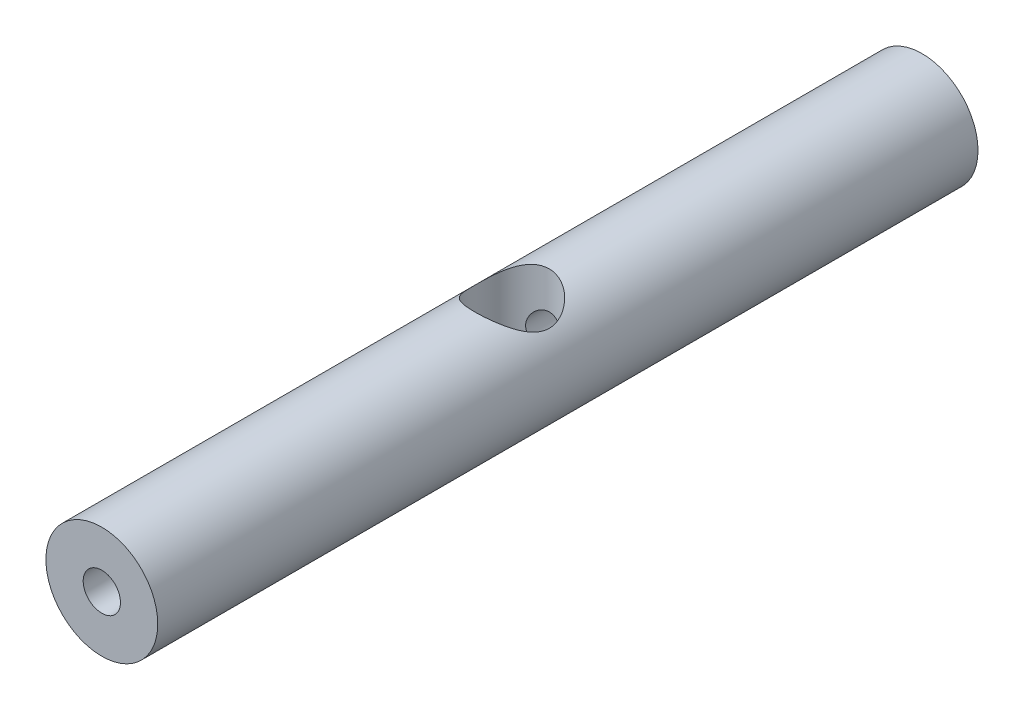
ISO-10303-21;
HEADER;
FILE_DESCRIPTION(('STEP AP214'),'2;1');
FILE_NAME('part.step','',(''),(''),'','','');
FILE_SCHEMA(('AUTOMOTIVE_DESIGN { 1 0 10303 214 1 1 1 1 }'));
ENDSEC;
DATA;
#1=APPLICATION_CONTEXT('core data for automotive mechanical design processes');
#2=APPLICATION_PROTOCOL_DEFINITION('international standard','automotive_design',2000,#1);
#3=PRODUCT_CONTEXT('',#1,'mechanical');
#4=PRODUCT('Part','Part','',(#3));
#5=PRODUCT_RELATED_PRODUCT_CATEGORY('part','',(#4));
#6=PRODUCT_DEFINITION_FORMATION('','',#4);
#7=PRODUCT_DEFINITION_CONTEXT('part definition',#1,'design');
#8=PRODUCT_DEFINITION('design','',#6,#7);
#9=PRODUCT_DEFINITION_SHAPE('','',#8);
#10=(LENGTH_UNIT() NAMED_UNIT(*) SI_UNIT(.MILLI.,.METRE.));
#11=(NAMED_UNIT(*) PLANE_ANGLE_UNIT() SI_UNIT($,.RADIAN.));
#12=(NAMED_UNIT(*) SI_UNIT($,.STERADIAN.) SOLID_ANGLE_UNIT());
#13=UNCERTAINTY_MEASURE_WITH_UNIT(LENGTH_MEASURE(1.E-05),#10,'distance_accuracy_value','');
#14=(GEOMETRIC_REPRESENTATION_CONTEXT(3) GLOBAL_UNCERTAINTY_ASSIGNED_CONTEXT((#13)) GLOBAL_UNIT_ASSIGNED_CONTEXT((#10,
#11,#12)) REPRESENTATION_CONTEXT('',''));
#15=CARTESIAN_POINT('',(0.,0.,0.));
#16=DIRECTION('',(0.,0.,1.));
#17=DIRECTION('',(1.,0.,0.));
#18=AXIS2_PLACEMENT_3D('',#15,#16,#17);
#19=CARTESIAN_POINT('',(0.,0.,132.));
#20=DIRECTION('',(0.,0.,-1.));
#21=DIRECTION('',(-1.,0.,0.));
#22=AXIS2_PLACEMENT_3D('',#19,#20,#21);
#23=CYLINDRICAL_SURFACE('',#22,3.);
#24=CARTESIAN_POINT('',(-3.,0.,71.1961524227066));
#25=CARTESIAN_POINT('',(-2.99999910875738,-0.0782002332591001,71.1961533815141));
#26=CARTESIAN_POINT('',(-2.99693611207795,-0.156409998464572,71.1979258119113));
#27=CARTESIAN_POINT('',(-2.98473565374509,-0.312208075142055,71.2049393165712));
#28=CARTESIAN_POINT('',(-2.97559536411629,-0.389796080268496,71.2101820056608));
#29=CARTESIAN_POINT('',(-2.9391691225804,-0.620944014246429,71.2308820055821));
#30=CARTESIAN_POINT('',(-2.902878058149,-0.772750910533257,71.2513107660722));
#31=CARTESIAN_POINT('',(-2.80829998089522,-1.06639163352355,71.3024774692754));
#32=CARTESIAN_POINT('',(-2.75012989346617,-1.2082738017509,71.3331605157792));
#33=CARTESIAN_POINT('',(-2.61380253964662,-1.48026276170082,71.4012807296697));
#34=CARTESIAN_POINT('',(-2.53564419197538,-1.61036891587492,71.4387182624135));
#35=CARTESIAN_POINT('',(-2.35399963256537,-1.86692014614772,71.5199058355984));
#36=CARTESIAN_POINT('',(-2.24895611137364,-1.99217820215593,71.5639218457163));
#37=CARTESIAN_POINT('',(-2.01976141989962,-2.22422436968954,71.651159547025));
#38=CARTESIAN_POINT('',(-1.89560077655245,-2.33100326825669,71.6943808324562));
#39=CARTESIAN_POINT('',(-1.62146869109162,-2.53010168773233,71.7786442898889));
#40=CARTESIAN_POINT('',(-1.47032156718995,-2.62096136592723,71.8193431875224));
#41=CARTESIAN_POINT('',(-1.1524710796464,-2.77542249742807,71.8905226880054));
#42=CARTESIAN_POINT('',(-0.985777614653097,-2.83904115324657,71.9210097369081));
#43=CARTESIAN_POINT('',(-0.65413483155629,-2.93251399798917,71.9664138360306));
#44=CARTESIAN_POINT('',(-0.489905370480172,-2.96444857964805,71.9822844059558));
#45=CARTESIAN_POINT('',(-0.157711887079236,-3.00049835544401,72.0002275160526));
#46=CARTESIAN_POINT('',(0.0102498138110328,-3.00463038213226,72.0023084049244));
#47=CARTESIAN_POINT('',(0.329497576667916,-2.98575996736519,71.9928894562274));
#48=CARTESIAN_POINT('',(0.480963609704586,-2.96508591192196,71.9825548724797));
#49=CARTESIAN_POINT('',(0.777941303579838,-2.90135750980351,71.9512273620779));
#50=CARTESIAN_POINT('',(0.923452517976627,-2.85830148842212,71.9302336378681));
#51=CARTESIAN_POINT('',(1.20692822064062,-2.75075214423043,71.8791474825337));
#52=CARTESIAN_POINT('',(1.34476044303001,-2.68597046879936,71.8489331854518));
#53=CARTESIAN_POINT('',(1.60793023199368,-2.53721034329205,71.7821294400464));
#54=CARTESIAN_POINT('',(1.73326330217191,-2.45322502049034,71.7455377104437));
#55=CARTESIAN_POINT('',(1.98052168794677,-2.25931152606046,71.665331584921));
#56=CARTESIAN_POINT('',(2.10100497271934,-2.14768148935835,71.6213803174283));
#57=CARTESIAN_POINT('',(2.32231036115798,-1.90624025809114,71.5336311808584));
#58=CARTESIAN_POINT('',(2.42311733790258,-1.77641520610432,71.4898334550261));
#59=CARTESIAN_POINT('',(2.6085269546345,-1.49201785665928,71.4043208466553));
#60=CARTESIAN_POINT('',(2.691694028528,-1.33639756435402,71.3629148575067));
#61=CARTESIAN_POINT('',(2.79542837524198,-1.09243694538825,71.3091519440867));
#62=CARTESIAN_POINT('',(2.82650797342001,-1.00934368959524,71.2926194649543));
#63=CARTESIAN_POINT('',(2.88131297532033,-0.840191396965576,71.2629847346327));
#64=CARTESIAN_POINT('',(2.90504291399185,-0.754134225525218,71.2498803689785));
#65=CARTESIAN_POINT('',(2.94323927983804,-0.586628379775977,71.2285545598839));
#66=CARTESIAN_POINT('',(2.95828810706486,-0.50535057436216,71.2200298226321));
#67=CARTESIAN_POINT('',(2.98163903200842,-0.341564761334108,71.2067273715729));
#68=CARTESIAN_POINT('',(2.98994463830255,-0.259057416251687,71.2019477092041));
#69=CARTESIAN_POINT('',(2.99968663811345,-0.0935289931972984,71.1963366286361));
#70=CARTESIAN_POINT('',(3.00112558946313,-0.0105081180563068,71.1955037402621));
#71=CARTESIAN_POINT('',(2.99712742537403,0.15528646076465,71.1978095319997));
#72=CARTESIAN_POINT('',(2.99169077406597,0.23806018075052,71.2009479440325));
#73=CARTESIAN_POINT('',(2.96710135231213,0.466859136042691,71.2150449301025));
#74=CARTESIAN_POINT('',(2.9405616310018,0.611910810263269,71.230191606605));
#75=CARTESIAN_POINT('',(2.8670906736223,0.895130910796864,71.270816663845));
#76=CARTESIAN_POINT('',(2.82015283383764,1.03329709183022,71.2962983902877));
#77=CARTESIAN_POINT('',(2.70494224478443,1.30622610391992,71.3560878027303));
#78=CARTESIAN_POINT('',(2.63578205088436,1.4405349279041,71.3907496041273));
#79=CARTESIAN_POINT('',(2.47886133231338,1.69640993836604,71.4646832779242));
#80=CARTESIAN_POINT('',(2.39109125263821,1.81796953081147,71.5039575138799));
#81=CARTESIAN_POINT('',(2.18651145695799,2.06093562663186,71.588640051403));
#82=CARTESIAN_POINT('',(2.067435804994,2.18039127090002,71.6341975208474));
#83=CARTESIAN_POINT('',(1.81021349814979,2.39823689529484,71.7220270231092));
#84=CARTESIAN_POINT('',(1.67206042712514,2.4966197596755,71.7642979430823));
#85=CARTESIAN_POINT('',(1.37560608443379,2.67172112757365,71.8422408580664));
#86=CARTESIAN_POINT('',(1.21686929217555,2.74779934188309,71.8777092522688));
#87=CARTESIAN_POINT('',(0.886567094469553,2.87141372431059,71.9365006466729));
#88=CARTESIAN_POINT('',(0.715013103124012,2.91897495484196,71.9598343091953));
#89=CARTESIAN_POINT('',(0.380939047947203,2.98010569184912,71.9900252464518));
#90=CARTESIAN_POINT('',(0.219034335650397,2.99639363556079,71.998197839307));
#91=CARTESIAN_POINT('',(-0.105377961951193,3.00252978843353,72.0012639091934));
#92=CARTESIAN_POINT('',(-0.267885316317455,2.99238725318317,71.9961620347605));
#93=CARTESIAN_POINT('',(-0.577613962536137,2.9477508098665,71.9740190719064));
#94=CARTESIAN_POINT('',(-0.725136901247721,2.91490556233434,71.9577868644244));
#95=CARTESIAN_POINT('',(-1.01233790874441,2.82801889196794,71.9157627855145));
#96=CARTESIAN_POINT('',(-1.15201484923628,2.77397442945753,71.8899695431946));
#97=CARTESIAN_POINT('',(-1.42627001605163,2.64381927131126,71.829778017116));
#98=CARTESIAN_POINT('',(-1.56037465678411,2.56686365846372,71.7950588762329));
#99=CARTESIAN_POINT('',(-1.81432469711303,2.39412457858644,71.7206436338201));
#100=CARTESIAN_POINT('',(-1.93416350676913,2.29833246401127,71.6809452494399));
#101=CARTESIAN_POINT('',(-2.16873884087782,2.07961527751646,71.5958597881944));
#102=CARTESIAN_POINT('',(-2.28178066887875,1.9549386792264,71.5502997550452));
#103=CARTESIAN_POINT('',(-2.48600225783028,1.68762167192986,71.4618864950968));
#104=CARTESIAN_POINT('',(-2.57716267726705,1.54496553896892,71.4190356875087));
#105=CARTESIAN_POINT('',(-2.69665559342489,1.31746820669823,71.3600477490699));
#106=CARTESIAN_POINT('',(-2.73405408762355,1.23802419901759,71.3410121914846));
#107=CARTESIAN_POINT('',(-2.80191257626505,1.07564671699129,71.3057278306372));
#108=CARTESIAN_POINT('',(-2.83237614466584,0.992715066252001,71.2894775930144));
#109=CARTESIAN_POINT('',(-2.88592624586958,0.824155267630252,71.2604521586818));
#110=CARTESIAN_POINT('',(-2.90903175649394,0.73853469275864,71.2476680350909));
#111=CARTESIAN_POINT('',(-2.9476242805163,0.565144744685739,71.2260886962511));
#112=CARTESIAN_POINT('',(-2.96311662049621,0.477376919079381,71.2172906924366));
#113=CARTESIAN_POINT('',(-2.9830938122572,0.324601182240059,71.2058852801613));
#114=CARTESIAN_POINT('',(-2.9894274622838,0.259905191093013,71.2022444258814));
#115=CARTESIAN_POINT('',(-2.99788106792142,0.130141683200318,71.1973775174469));
#116=CARTESIAN_POINT('',(-3.00000074164547,0.0650741418923936,71.1961516248372));
#117=CARTESIAN_POINT('',(-3.,0.,71.1961524227066));
#118=B_SPLINE_CURVE_WITH_KNOTS('',3,(#24,#25,#26,#27,#28,#29,#30,#31,#32,#33,#34,#35,#36,#37,
#38,#39,#40,#41,#42,#43,#44,#45,#46,#47,#48,#49,#50,#51,#52,#53,#54,#55,#56,#57,#58,#59,#60,#61,
#62,#63,#64,#65,#66,#67,#68,#69,#70,#71,#72,#73,#74,#75,#76,#77,#78,#79,#80,#81,#82,#83,#84,#85,
#86,#87,#88,#89,#90,#91,#92,#93,#94,#95,#96,#97,#98,#99,#100,#101,#102,#103,#104,#105,#106,#107,
#108,#109,#110,#111,#112,#113,#114,#115,#116,#117),.UNSPECIFIED.,.T.,.F.,(4,2,2,2,2,2,2,2,2,2,2,
2,2,2,2,2,2,2,2,2,2,2,2,2,2,2,2,2,2,2,2,2,2,2,2,2,2,2,2,2,2,2,2,2,2,2,4),(0.,0.234529430733891,
0.469168072604263,0.93885038329453,1.40605749261242,1.87328988121656,2.37905864237582,
2.88507883741224,3.42520847204401,3.96499651379785,4.46637625391917,4.96745241546231,
5.42495462941727,5.88249108040477,6.34635774681552,6.81039068538928,7.31828744858783,
7.82657315225867,8.36713695676456,8.63752916119813,8.90775419202327,9.15669600787593,
9.40550821320573,9.65422772860786,9.90293045534219,10.3454331624118,10.7880792327729,
11.2512265518736,11.7146122462924,12.2364099671094,12.7583836090371,13.29413310208,
13.8294110539541,14.3155757713756,14.8015702635101,15.2555404058358,15.7095756650514,
16.1830301812752,16.6567025627126,17.177514915193,17.6987859450456,17.9680115893229,
18.2370981707631,18.5054849980179,18.7736837791728,18.9688338446807,19.1639969639894),.UNSPECIFIED.);
#119=CARTESIAN_POINT('',(-3.,0.,71.1961524227066));
#120=VERTEX_POINT('',#119);
#121=EDGE_CURVE('E41',#120,#120,#118,.T.);
#122=ORIENTED_EDGE('',*,*,#121,.F.);
#123=EDGE_LOOP('',(#122));
#124=FACE_BOUND('',#123,.T.);
#125=CARTESIAN_POINT('',(0.,0.,132.));
#126=DIRECTION('',(0.,0.,1.));
#127=DIRECTION('',(1.,0.,0.));
#128=AXIS2_PLACEMENT_3D('',#125,#126,#127);
#129=CIRCLE('',#128,3.);
#130=CARTESIAN_POINT('',(3.,0.,132.));
#131=VERTEX_POINT('',#130);
#132=EDGE_CURVE('E55',#131,#131,#129,.T.);
#133=ORIENTED_EDGE('',*,*,#132,.T.);
#134=EDGE_LOOP('',(#133));
#135=FACE_BOUND('',#134,.T.);
#136=ADVANCED_FACE('F36',(#124,#135),#23,.F.);
#137=CARTESIAN_POINT('',(0.,0.,132.));
#138=DIRECTION('',(0.,0.,1.));
#139=DIRECTION('',(1.,0.,0.));
#140=AXIS2_PLACEMENT_3D('',#137,#138,#139);
#141=PLANE('',#140);
#142=CARTESIAN_POINT('',(0.,0.,132.));
#143=DIRECTION('',(0.,0.,1.));
#144=DIRECTION('',(1.,0.,0.));
#145=AXIS2_PLACEMENT_3D('',#142,#143,#144);
#146=CIRCLE('',#145,9.);
#147=CARTESIAN_POINT('',(9.,0.,132.));
#148=VERTEX_POINT('',#147);
#149=EDGE_CURVE('E10',#148,#148,#146,.T.);
#150=ORIENTED_EDGE('',*,*,#149,.T.);
#151=EDGE_LOOP('',(#150));
#152=FACE_BOUND('',#151,.T.);
#153=ORIENTED_EDGE('',*,*,#132,.F.);
#154=EDGE_LOOP('',(#153));
#155=FACE_BOUND('',#154,.T.);
#156=ADVANCED_FACE('F103',(#152,#155),#141,.T.);
#157=CARTESIAN_POINT('',(0.,0.,0.));
#158=DIRECTION('',(0.,0.,1.));
#159=DIRECTION('',(1.,0.,0.));
#160=AXIS2_PLACEMENT_3D('',#157,#158,#159);
#161=PLANE('',#160);
#162=CARTESIAN_POINT('',(0.,0.,0.));
#163=DIRECTION('',(0.,0.,1.));
#164=DIRECTION('',(1.,0.,0.));
#165=AXIS2_PLACEMENT_3D('',#162,#163,#164);
#166=CIRCLE('',#165,9.);
#167=CARTESIAN_POINT('',(9.,0.,0.));
#168=VERTEX_POINT('',#167);
#169=EDGE_CURVE('E50',#168,#168,#166,.T.);
#170=ORIENTED_EDGE('',*,*,#169,.F.);
#171=EDGE_LOOP('',(#170));
#172=FACE_BOUND('',#171,.T.);
#173=CARTESIAN_POINT('',(0.,0.,0.));
#174=DIRECTION('',(0.,0.,1.));
#175=DIRECTION('',(1.,0.,0.));
#176=AXIS2_PLACEMENT_3D('',#173,#174,#175);
#177=CIRCLE('',#176,3.);
#178=CARTESIAN_POINT('',(3.,0.,0.));
#179=VERTEX_POINT('',#178);
#180=EDGE_CURVE('E58',#179,#179,#177,.T.);
#181=ORIENTED_EDGE('',*,*,#180,.T.);
#182=EDGE_LOOP('',(#181));
#183=FACE_BOUND('',#182,.T.);
#184=ADVANCED_FACE('F93',(#172,#183),#161,.F.);
#185=CARTESIAN_POINT('',(0.,0.,132.));
#186=DIRECTION('',(0.,0.,-1.));
#187=DIRECTION('',(-1.,0.,0.));
#188=AXIS2_PLACEMENT_3D('',#185,#186,#187);
#189=CYLINDRICAL_SURFACE('',#188,9.);
#190=CARTESIAN_POINT('',(0.,-9.,72.));
#191=CARTESIAN_POINT('',(0.150729622305847,-8.99999995585147,71.9999999559956));
#192=CARTESIAN_POINT('',(0.30146000506175,-8.9962053679738,71.9943125473159));
#193=CARTESIAN_POINT('',(0.601688556515674,-8.98112265027612,71.9716526321313));
#194=CARTESIAN_POINT('',(0.751186718723976,-8.96983448101525,71.9546800662295));
#195=CARTESIAN_POINT('',(1.04780606417449,-8.94004058807467,71.9097046619316));
#196=CARTESIAN_POINT('',(1.19492680669762,-8.92153354180874,71.8816998022755));
#197=CARTESIAN_POINT('',(1.48576112693977,-8.87773364005912,71.8150481308273));
#198=CARTESIAN_POINT('',(1.62947322817571,-8.85243790037608,71.7763967956597));
#199=CARTESIAN_POINT('',(1.91177872558019,-8.79577830450418,71.6891836618752));
#200=CARTESIAN_POINT('',(2.05039477937361,-8.76444655793924,71.6406742333665));
#201=CARTESIAN_POINT('',(2.32256233058594,-8.69628785219886,71.5341745859493));
#202=CARTESIAN_POINT('',(2.45611182989863,-8.659458752704,71.4761806735416));
#203=CARTESIAN_POINT('',(2.84809658114958,-8.5418139271305,71.2888649014295));
#204=CARTESIAN_POINT('',(3.09811195500101,-8.4537898193218,71.1461324710248));
#205=CARTESIAN_POINT('',(3.59189330885236,-8.25681534514022,70.8160181983792));
#206=CARTESIAN_POINT('',(3.83332869268148,-8.1467230749831,70.6258753146249));
#207=CARTESIAN_POINT('',(4.28319637469339,-7.91945321886923,70.2127909305365));
#208=CARTESIAN_POINT('',(4.49158048555778,-7.80226562576429,69.9898024392184));
#209=CARTESIAN_POINT('',(4.79239457135195,-7.61903553612194,69.6144242929305));
#210=CARTESIAN_POINT('',(4.89672662856445,-7.55221574084949,69.4717966225412));
#211=CARTESIAN_POINT('',(5.09292728943465,-7.42132140336271,69.1770239207678));
#212=CARTESIAN_POINT('',(5.18479306305095,-7.35724748675706,69.0248767397213));
#213=CARTESIAN_POINT('',(5.44039994615966,-7.17258665154311,68.5551487541104));
#214=CARTESIAN_POINT('',(5.58476240011457,-7.05916900886956,68.2235231774815));
#215=CARTESIAN_POINT('',(5.78024082559468,-6.89928079390124,67.6297790727978));
#216=CARTESIAN_POINT('',(5.84624506230704,-6.84293565925667,67.3752375741416));
#217=CARTESIAN_POINT('',(5.91998570312694,-6.77899474935292,66.9855329434063));
#218=CARTESIAN_POINT('',(5.94035188146208,-6.76111360358516,66.8543697224215));
#219=CARTESIAN_POINT('',(5.97238672990614,-6.7328353656429,66.5901574587245));
#220=CARTESIAN_POINT('',(5.9840553523498,-6.72243831448352,66.4571084056815));
#221=CARTESIAN_POINT('',(5.99850615759971,-6.70954663359649,66.1895908995565));
#222=CARTESIAN_POINT('',(6.00125134141578,-6.70708490621809,66.055118850243));
#223=CARTESIAN_POINT('',(5.99770198955946,-6.71025905496977,65.7863915252174));
#224=CARTESIAN_POINT('',(5.9914074231807,-6.71589495860601,65.6521362502431));
#225=CARTESIAN_POINT('',(5.96988769246359,-6.73503137215892,65.3848377078067));
#226=CARTESIAN_POINT('',(5.95465768785754,-6.74853614456245,65.2517951369556));
#227=CARTESIAN_POINT('',(5.91553265422361,-6.78285629118457,64.9879261164484));
#228=CARTESIAN_POINT('',(5.89163397696999,-6.80367474326148,64.8571006241537));
#229=CARTESIAN_POINT('',(5.80996444024943,-6.87381692297076,64.4807585202742));
#230=CARTESIAN_POINT('',(5.74115656052931,-6.93184442552376,64.2391604481481));
#231=CARTESIAN_POINT('',(5.57609833845702,-7.06528890582514,63.7708844550503));
#232=CARTESIAN_POINT('',(5.47983896595981,-7.14071160414417,63.5442114739251));
#233=CARTESIAN_POINT('',(5.24022208796984,-7.31892320954063,63.0629456381566));
#234=CARTESIAN_POINT('',(5.09126717645734,-7.42415802950434,62.8120520699891));
#235=CARTESIAN_POINT('',(4.76004317394312,-7.64075764898376,62.3358180033));
#236=CARTESIAN_POINT('',(4.57773299424654,-7.75212988931612,62.1105095828303));
#237=CARTESIAN_POINT('',(4.25962918712963,-7.92935002667425,61.7707528113235));
#238=CARTESIAN_POINT('',(4.13357696363757,-7.99594629678862,61.6474427734314));
#239=CARTESIAN_POINT('',(3.87038124621715,-8.12660477277739,61.411827223816));
#240=CARTESIAN_POINT('',(3.73324106763131,-8.19066772765438,61.2995184447223));
#241=CARTESIAN_POINT('',(3.44840396167416,-8.31460339064872,61.0867427032238));
#242=CARTESIAN_POINT('',(3.30071231639902,-8.37447816608008,60.9862698815132));
#243=CARTESIAN_POINT('',(2.99534256192436,-8.48848992914057,60.7980709141005));
#244=CARTESIAN_POINT('',(2.83766721772882,-8.54262849441553,60.7103412611342));
#245=CARTESIAN_POINT('',(2.54499814107467,-8.63375113458628,60.5645399537867));
#246=CARTESIAN_POINT('',(2.41161567122494,-8.67201774379611,60.504025505963));
#247=CARTESIAN_POINT('',(2.1395432193142,-8.74311799376198,60.3925086947129));
#248=CARTESIAN_POINT('',(2.00085431903208,-8.77595273467916,60.3415044048491));
#249=CARTESIAN_POINT('',(1.71897681367333,-8.83548832961116,60.2496018557594));
#250=CARTESIAN_POINT('',(1.57579110331518,-8.86219304127522,60.2086972395404));
#251=CARTESIAN_POINT('',(1.28572629859266,-8.9088991637229,60.1374742840091));
#252=CARTESIAN_POINT('',(1.13884714744994,-8.92890047138895,60.1071561075462));
#253=CARTESIAN_POINT('',(0.841791942137075,-8.96179736848291,60.0574280058098));
#254=CARTESIAN_POINT('',(0.691604277461544,-8.97466149510723,60.0380663728554));
#255=CARTESIAN_POINT('',(0.389735976642209,-8.99282868173345,60.0107536328989));
#256=CARTESIAN_POINT('',(0.238055338547848,-8.99813173185554,60.0028025408066));
#257=CARTESIAN_POINT('',(-0.0655394290023317,-9.00104153419543,59.9984375957279));
#258=CARTESIAN_POINT('',(-0.21745354857653,-8.9986486036265,60.0020232672186));
#259=CARTESIAN_POINT('',(-0.520254440302942,-8.98622801322276,60.0206737424055));
#260=CARTESIAN_POINT('',(-0.671141256025337,-8.97620067924044,60.035738056169));
#261=CARTESIAN_POINT('',(-0.960099063451837,-8.94973490388407,60.0756468841774));
#262=CARTESIAN_POINT('',(-1.09832305580763,-8.93379881037894,60.0997262199985));
#263=CARTESIAN_POINT('',(-1.37199636544237,-8.89588211668836,60.1572962205978));
#264=CARTESIAN_POINT('',(-1.50744472377706,-8.87389946410455,60.1907900810558));
#265=CARTESIAN_POINT('',(-1.77469424179228,-8.82433671407074,60.2667853981939));
#266=CARTESIAN_POINT('',(-1.90649647878767,-8.79675829050981,60.3092841613634));
#267=CARTESIAN_POINT('',(-2.1658509536026,-8.7365239583071,60.402846845352));
#268=CARTESIAN_POINT('',(-2.29340153573778,-8.70386609903955,60.453914057258));
#269=CARTESIAN_POINT('',(-2.6838456858226,-8.5949191182637,60.6259059367114));
#270=CARTESIAN_POINT('',(-2.93844728759671,-8.51070479139786,60.7610487628929));
#271=CARTESIAN_POINT('',(-3.42209036372161,-8.32804697564181,61.0633155789126));
#272=CARTESIAN_POINT('',(-3.65111591352081,-8.22959470828607,61.2304593198005));
#273=CARTESIAN_POINT('',(-4.11554429130496,-8.0086435844533,61.6218098942814));
#274=CARTESIAN_POINT('',(-4.34622868572373,-7.88480405646166,61.8508606735172));
#275=CARTESIAN_POINT('',(-4.76804600199323,-7.63711582679969,62.3433724228123));
#276=CARTESIAN_POINT('',(-4.95915158704086,-7.51326717750209,62.6068569725143));
#277=CARTESIAN_POINT('',(-5.20616918569022,-7.34198751964741,63.013675515455));
#278=CARTESIAN_POINT('',(-5.27921697702153,-7.28951977901592,63.144730681585));
#279=CARTESIAN_POINT('',(-5.41584589984555,-7.18858887021074,63.4132448734983));
#280=CARTESIAN_POINT('',(-5.47942590699138,-7.14012617796028,63.5507046573213));
#281=CARTESIAN_POINT('',(-5.59646403292409,-7.04876602779049,63.8314319756609));
#282=CARTESIAN_POINT('',(-5.64993546336318,-7.00586127458741,63.9746915662796));
#283=CARTESIAN_POINT('',(-5.74620164834171,-6.92712329196491,64.2665774033504));
#284=CARTESIAN_POINT('',(-5.78900316794111,-6.89128558484322,64.4152001805847));
#285=CARTESIAN_POINT('',(-5.85661826485718,-6.83385842215743,64.6899288398305));
#286=CARTESIAN_POINT('',(-5.88328161294608,-6.81086609963069,64.8152877145369));
#287=CARTESIAN_POINT('',(-5.92862999751556,-6.77142914495135,65.0684079319194));
#288=CARTESIAN_POINT('',(-5.94731901928204,-6.75498124240745,65.1961680411329));
#289=CARTESIAN_POINT('',(-5.97643608474823,-6.72923413020984,65.4532527383072));
#290=CARTESIAN_POINT('',(-5.98687017789309,-6.7199296857762,65.5825761099697));
#291=CARTESIAN_POINT('',(-5.99932331015652,-6.70881432384085,65.841953936801));
#292=CARTESIAN_POINT('',(-6.0013422264647,-6.70700351570064,65.9720084026117));
#293=CARTESIAN_POINT('',(-5.99692459405667,-6.71095435083986,66.2319359573732));
#294=CARTESIAN_POINT('',(-5.99048321844488,-6.71672031693769,66.3618089004262));
#295=CARTESIAN_POINT('',(-5.96925971270465,-6.73558614063362,66.6203056654351));
#296=CARTESIAN_POINT('',(-5.9544776509522,-6.74868593810979,66.7489294976222));
#297=CARTESIAN_POINT('',(-5.8979128416254,-6.79832833535244,67.1318647125822));
#298=CARTESIAN_POINT('',(-5.84391363215309,-6.84521161664421,67.3831292912321));
#299=CARTESIAN_POINT('',(-5.68777703693195,-6.97580808966408,67.9372270880153));
#300=CARTESIAN_POINT('',(-5.57664669562185,-7.06600625405689,68.2359610485461));
#301=CARTESIAN_POINT('',(-5.37860347419035,-7.21647622558034,68.6637263087604));
#302=CARTESIAN_POINT('',(-5.30726989328924,-7.26922722643007,68.8030656675778));
#303=CARTESIAN_POINT('',(-5.154639758458,-7.378245130227,69.0747269827798));
#304=CARTESIAN_POINT('',(-5.07334373068853,-7.43451184741688,69.2070493092364));
#305=CARTESIAN_POINT('',(-4.8120150244346,-7.60845890956524,69.5977568443694));
#306=CARTESIAN_POINT('',(-4.6168726569658,-7.72943088955527,69.8448777899198));
#307=CARTESIAN_POINT('',(-4.2968402603375,-7.90899770516147,70.1906880637421));
#308=CARTESIAN_POINT('',(-4.18555156787561,-7.96856536389414,70.3018588442767));
#309=CARTESIAN_POINT('',(-3.95402212651264,-8.08594615360418,70.5155863679172));
#310=CARTESIAN_POINT('',(-3.83378004004318,-8.14375902060585,70.6181418190689));
#311=CARTESIAN_POINT('',(-3.56674436267312,-8.26455070132617,70.8281675576757));
#312=CARTESIAN_POINT('',(-3.41862163544373,-8.32707326839164,70.9342161290834));
#313=CARTESIAN_POINT('',(-3.11179261111769,-8.44652770995563,71.1332408379606));
#314=CARTESIAN_POINT('',(-2.95309094593361,-8.50346200459068,71.2262226419095));
#315=CARTESIAN_POINT('',(-2.62603732034738,-8.61008023006581,71.3979633421141));
#316=CARTESIAN_POINT('',(-2.45769464324872,-8.65977097748359,71.4767356271097));
#317=CARTESIAN_POINT('',(-2.11241130934656,-8.75040224410028,71.6189451362716));
#318=CARTESIAN_POINT('',(-1.93547369822185,-8.79134583555446,71.6823877456944));
#319=CARTESIAN_POINT('',(-1.61466512300624,-8.85513177713005,71.7805203990962));
#320=CARTESIAN_POINT('',(-1.47217899361136,-8.87997472899837,71.8184668759046));
#321=CARTESIAN_POINT('',(-1.1838494274297,-8.92298887352277,71.8839052354017));
#322=CARTESIAN_POINT('',(-1.03800668802837,-8.94116143898747,71.9113992693123));
#323=CARTESIAN_POINT('',(-0.744070656079128,-8.97040466661752,71.9555380082854));
#324=CARTESIAN_POINT('',(-0.595978754591699,-8.98147954900223,71.972189160524));
#325=CARTESIAN_POINT('',(-0.298591514040661,-8.99627737544156,71.9944203858096));
#326=CARTESIAN_POINT('',(-0.149296130047598,-9.00000004372866,72.0000000435859));
#327=CARTESIAN_POINT('',(0.,-9.,72.));
#328=B_SPLINE_CURVE_WITH_KNOTS('',3,(#190,#191,#192,#193,#194,#195,#196,#197,#198,#199,#200,
#201,#202,#203,#204,#205,#206,#207,#208,#209,#210,#211,#212,#213,#214,#215,#216,#217,#218,#219,
#220,#221,#222,#223,#224,#225,#226,#227,#228,#229,#230,#231,#232,#233,#234,#235,#236,#237,#238,
#239,#240,#241,#242,#243,#244,#245,#246,#247,#248,#249,#250,#251,#252,#253,#254,#255,#256,#257,
#258,#259,#260,#261,#262,#263,#264,#265,#266,#267,#268,#269,#270,#271,#272,#273,#274,#275,#276,
#277,#278,#279,#280,#281,#282,#283,#284,#285,#286,#287,#288,#289,#290,#291,#292,#293,#294,#295,
#296,#297,#298,#299,#300,#301,#302,#303,#304,#305,#306,#307,#308,#309,#310,#311,#312,#313,#314,
#315,#316,#317,#318,#319,#320,#321,#322,#323,#324,#325,#326,#327),.UNSPECIFIED.,.T.,.F.,(4,2,2,
2,2,2,2,2,2,2,2,2,2,2,2,2,2,2,2,2,2,2,2,2,2,2,2,2,2,2,2,2,2,2,2,2,2,2,2,2,2,2,2,2,2,2,2,2,2,2,2,
2,2,2,2,2,2,2,2,2,2,2,2,2,2,2,2,2,4),(0.,0.452036580111442,0.904075539438478,1.35619735674,
1.80851156444626,2.25848292496265,2.70862993486738,3.60815079131828,4.58400234529208,
5.56126382339349,6.12742047182467,6.69370543242381,7.8231640969075,8.62651574382519,
9.0278725189518,9.42923149361958,9.83225250256984,10.235274880511,10.6385157748351,
11.0419265710542,11.8122805192037,12.5828881675017,13.5102418931755,14.438745766751,
15.0036483176992,15.5683825808065,16.1328360908595,16.6971339525005,17.1508351664973,
17.6044443758377,18.0577673398902,18.5110972770303,18.9664100624721,19.4217234428555,
19.8770180563533,20.3322932380041,20.7554408923732,21.1787323544093,21.6018973814773,
22.0252253171915,22.9223330679288,23.8199963113995,24.8596079472821,25.8999352583161,
26.3764167766424,26.8529548344919,27.3288609157664,27.804464485721,28.1946952569021,
28.5847307754859,28.9744801995659,29.3642353115958,29.7542128893159,30.1441872700904,
30.924463377126,31.9126539226798,32.4078257816576,32.9029714996922,33.9105674544882,
34.4148344031001,34.9191768370557,35.4962031918118,36.0729785384255,36.6492075542345,
37.225233847725,37.673313493046,38.1213008689068,38.5690216277127,39.0167591793511),.UNSPECIFIED.);
#329=CARTESIAN_POINT('',(0.,-9.,72.));
#330=VERTEX_POINT('',#329);
#331=EDGE_CURVE('E82',#330,#330,#328,.T.);
#332=ORIENTED_EDGE('',*,*,#331,.T.);
#333=EDGE_LOOP('',(#332));
#334=FACE_BOUND('',#333,.T.);
#335=CARTESIAN_POINT('',(0.,9.,72.));
#336=CARTESIAN_POINT('',(-0.15072962230584,8.99999995585147,71.9999999559956));
#337=CARTESIAN_POINT('',(-0.301460005061743,8.9962053679738,71.9943125473159));
#338=CARTESIAN_POINT('',(-0.601688556515667,8.98112265027612,71.9716526321313));
#339=CARTESIAN_POINT('',(-0.751186718723969,8.96983448101525,71.9546800662295));
#340=CARTESIAN_POINT('',(-1.04780606417449,8.94004058807467,71.9097046619316));
#341=CARTESIAN_POINT('',(-1.19492680669761,8.92153354180874,71.8816998022755));
#342=CARTESIAN_POINT('',(-1.48576112693976,8.87773364005912,71.8150481308273));
#343=CARTESIAN_POINT('',(-1.6294732281757,8.85243790037608,71.7763967956597));
#344=CARTESIAN_POINT('',(-1.91177872558018,8.79577830450419,71.6891836618752));
#345=CARTESIAN_POINT('',(-2.05039477937361,8.76444655793925,71.6406742333665));
#346=CARTESIAN_POINT('',(-2.32256233058594,8.69628785219887,71.5341745859493));
#347=CARTESIAN_POINT('',(-2.45611182989862,8.659458752704,71.4761806735416));
#348=CARTESIAN_POINT('',(-2.84809658114958,8.54181392713049,71.2888649014295));
#349=CARTESIAN_POINT('',(-3.09811195500101,8.45378981932179,71.1461324710248));
#350=CARTESIAN_POINT('',(-3.59189330885235,8.25681534514022,70.8160181983792));
#351=CARTESIAN_POINT('',(-3.83332869268147,8.1467230749831,70.6258753146249));
#352=CARTESIAN_POINT('',(-4.28319637469338,7.91945321886924,70.2127909305365));
#353=CARTESIAN_POINT('',(-4.49158048555777,7.8022656257643,69.9898024392184));
#354=CARTESIAN_POINT('',(-4.79239457135194,7.61903553612194,69.6144242929305));
#355=CARTESIAN_POINT('',(-4.89672662856444,7.5522157408495,69.4717966225412));
#356=CARTESIAN_POINT('',(-5.09292728943464,7.42132140336272,69.1770239207678));
#357=CARTESIAN_POINT('',(-5.18479306305094,7.35724748675707,69.0248767397213));
#358=CARTESIAN_POINT('',(-5.44039994615965,7.17258665154312,68.5551487541104));
#359=CARTESIAN_POINT('',(-5.58476240011456,7.05916900886957,68.2235231774815));
#360=CARTESIAN_POINT('',(-5.78024082559467,6.89928079390125,67.6297790727978));
#361=CARTESIAN_POINT('',(-5.84624506230703,6.84293565925668,67.3752375741416));
#362=CARTESIAN_POINT('',(-5.91998570312693,6.77899474935293,66.9855329434063));
#363=CARTESIAN_POINT('',(-5.94035188146207,6.76111360358517,66.8543697224215));
#364=CARTESIAN_POINT('',(-5.97238672990613,6.73283536564291,66.5901574587245));
#365=CARTESIAN_POINT('',(-5.98405535234979,6.72243831448354,66.4571084056815));
#366=CARTESIAN_POINT('',(-5.99850615759969,6.7095466335965,66.1895908995565));
#367=CARTESIAN_POINT('',(-6.00125134141577,6.7070849062181,66.055118850243));
#368=CARTESIAN_POINT('',(-5.99770198955944,6.71025905496979,65.7863915252173));
#369=CARTESIAN_POINT('',(-5.99140742318069,6.71589495860602,65.6521362502431));
#370=CARTESIAN_POINT('',(-5.96988769246357,6.73503137215894,65.3848377078067));
#371=CARTESIAN_POINT('',(-5.95465768785752,6.74853614456246,65.2517951369555));
#372=CARTESIAN_POINT('',(-5.91553265422359,6.78285629118458,64.9879261164483));
#373=CARTESIAN_POINT('',(-5.89163397696997,6.8036747432615,64.8571006241537));
#374=CARTESIAN_POINT('',(-5.80996444024941,6.87381692297078,64.4807585202742));
#375=CARTESIAN_POINT('',(-5.74115656052929,6.93184442552378,64.2391604481481));
#376=CARTESIAN_POINT('',(-5.576098338457,7.06528890582516,63.7708844550503));
#377=CARTESIAN_POINT('',(-5.47983896595979,7.14071160414419,63.5442114739251));
#378=CARTESIAN_POINT('',(-5.24022208796981,7.31892320954065,63.0629456381566));
#379=CARTESIAN_POINT('',(-5.09126717645732,7.42415802950436,62.8120520699891));
#380=CARTESIAN_POINT('',(-4.76004317394309,7.64075764898377,62.3358180033));
#381=CARTESIAN_POINT('',(-4.5777329942465,7.75212988931613,62.1105095828303));
#382=CARTESIAN_POINT('',(-4.2596291871296,7.92935002667426,61.7707528113235));
#383=CARTESIAN_POINT('',(-4.13357696363754,7.99594629678864,61.6474427734313));
#384=CARTESIAN_POINT('',(-3.87038124621711,8.12660477277741,61.411827223816));
#385=CARTESIAN_POINT('',(-3.73324106763127,8.19066772765439,61.2995184447222));
#386=CARTESIAN_POINT('',(-3.44840396167413,8.31460339064873,61.0867427032238));
#387=CARTESIAN_POINT('',(-3.30071231639898,8.37447816608009,60.9862698815132));
#388=CARTESIAN_POINT('',(-2.99534256192432,8.48848992914058,60.7980709141005));
#389=CARTESIAN_POINT('',(-2.83766721772878,8.54262849441554,60.7103412611342));
#390=CARTESIAN_POINT('',(-2.54499814107463,8.63375113458629,60.5645399537866));
#391=CARTESIAN_POINT('',(-2.4116156712249,8.67201774379612,60.504025505963));
#392=CARTESIAN_POINT('',(-2.13954321931416,8.74311799376199,60.3925086947129));
#393=CARTESIAN_POINT('',(-2.00085431903204,8.77595273467917,60.3415044048491));
#394=CARTESIAN_POINT('',(-1.71897681367329,8.83548832961117,60.2496018557594));
#395=CARTESIAN_POINT('',(-1.57579110331514,8.86219304127523,60.2086972395404));
#396=CARTESIAN_POINT('',(-1.28572629859262,8.90889916372291,60.1374742840091));
#397=CARTESIAN_POINT('',(-1.1388471474499,8.92890047138895,60.1071561075462));
#398=CARTESIAN_POINT('',(-0.841791942137032,8.96179736848291,60.0574280058098));
#399=CARTESIAN_POINT('',(-0.691604277461502,8.97466149510724,60.0380663728554));
#400=CARTESIAN_POINT('',(-0.389735976642169,8.99282868173345,60.0107536328989));
#401=CARTESIAN_POINT('',(-0.238055338547809,8.99813173185554,60.0028025408066));
#402=CARTESIAN_POINT('',(0.0655394290023699,9.00104153419544,59.9984375957279));
#403=CARTESIAN_POINT('',(0.217453548576568,8.9986486036265,60.0020232672186));
#404=CARTESIAN_POINT('',(0.52025444030298,8.98622801322276,60.0206737424055));
#405=CARTESIAN_POINT('',(0.671141256025374,8.97620067924044,60.035738056169));
#406=CARTESIAN_POINT('',(0.960099063451873,8.94973490388406,60.0756468841774));
#407=CARTESIAN_POINT('',(1.09832305580766,8.93379881037893,60.0997262199985));
#408=CARTESIAN_POINT('',(1.37199636544241,8.89588211668836,60.1572962205978));
#409=CARTESIAN_POINT('',(1.50744472377709,8.87389946410454,60.1907900810558));
#410=CARTESIAN_POINT('',(1.77469424179232,8.82433671407073,60.2667853981939));
#411=CARTESIAN_POINT('',(1.9064964787877,8.7967582905098,60.3092841613634));
#412=CARTESIAN_POINT('',(2.16585095360264,8.73652395830709,60.402846845352));
#413=CARTESIAN_POINT('',(2.29340153573782,8.70386609903954,60.453914057258));
#414=CARTESIAN_POINT('',(2.68384568582264,8.59491911826369,60.6259059367114));
#415=CARTESIAN_POINT('',(2.93844728759674,8.51070479139785,60.7610487628929));
#416=CARTESIAN_POINT('',(3.42209036372164,8.3280469756418,61.0633155789126));
#417=CARTESIAN_POINT('',(3.65111591352084,8.22959470828606,61.2304593198005));
#418=CARTESIAN_POINT('',(4.115544291305,8.00864358445329,61.6218098942814));
#419=CARTESIAN_POINT('',(4.34622868572376,7.88480405646165,61.8508606735172));
#420=CARTESIAN_POINT('',(4.76804600199326,7.63711582679967,62.3433724228123));
#421=CARTESIAN_POINT('',(4.95915158704088,7.51326717750207,62.6068569725143));
#422=CARTESIAN_POINT('',(5.20616918569024,7.34198751964739,63.013675515455));
#423=CARTESIAN_POINT('',(5.27921697702155,7.28951977901591,63.144730681585));
#424=CARTESIAN_POINT('',(5.41584589984558,7.18858887021073,63.4132448734983));
#425=CARTESIAN_POINT('',(5.4794259069914,7.14012617796026,63.5507046573213));
#426=CARTESIAN_POINT('',(5.59646403292411,7.04876602779047,63.8314319756609));
#427=CARTESIAN_POINT('',(5.6499354633632,7.0058612745874,63.9746915662796));
#428=CARTESIAN_POINT('',(5.74620164834173,6.92712329196489,64.2665774033504));
#429=CARTESIAN_POINT('',(5.78900316794112,6.89128558484321,64.4152001805847));
#430=CARTESIAN_POINT('',(5.8566182648572,6.83385842215741,64.6899288398305));
#431=CARTESIAN_POINT('',(5.8832816129461,6.81086609963067,64.8152877145369));
#432=CARTESIAN_POINT('',(5.92862999751558,6.77142914495133,65.0684079319194));
#433=CARTESIAN_POINT('',(5.94731901928205,6.75498124240743,65.1961680411329));
#434=CARTESIAN_POINT('',(5.97643608474824,6.72923413020983,65.4532527383073));
#435=CARTESIAN_POINT('',(5.98687017789311,6.71992968577618,65.5825761099697));
#436=CARTESIAN_POINT('',(5.99932331015654,6.70881432384083,65.841953936801));
#437=CARTESIAN_POINT('',(6.00134222646472,6.70700351570062,65.9720084026117));
#438=CARTESIAN_POINT('',(5.99692459405669,6.71095435083985,66.2319359573732));
#439=CARTESIAN_POINT('',(5.9904832184449,6.71672031693768,66.3618089004262));
#440=CARTESIAN_POINT('',(5.96925971270466,6.73558614063361,66.6203056654351));
#441=CARTESIAN_POINT('',(5.95447765095221,6.74868593810978,66.7489294976222));
#442=CARTESIAN_POINT('',(5.89791284162541,6.79832833535243,67.1318647125822));
#443=CARTESIAN_POINT('',(5.8439136321531,6.8452116166442,67.3831292912321));
#444=CARTESIAN_POINT('',(5.68777703693196,6.97580808966407,67.9372270880153));
#445=CARTESIAN_POINT('',(5.57664669562185,7.06600625405689,68.2359610485461));
#446=CARTESIAN_POINT('',(5.37860347419036,7.21647622558033,68.6637263087604));
#447=CARTESIAN_POINT('',(5.30726989328925,7.26922722643006,68.8030656675778));
#448=CARTESIAN_POINT('',(5.15463975845802,7.37824513022699,69.0747269827798));
#449=CARTESIAN_POINT('',(5.07334373068855,7.43451184741687,69.2070493092364));
#450=CARTESIAN_POINT('',(4.81201502443462,7.60845890956523,69.5977568443694));
#451=CARTESIAN_POINT('',(4.61687265696582,7.72943088955526,69.8448777899197));
#452=CARTESIAN_POINT('',(4.29684026033753,7.90899770516145,70.1906880637421));
#453=CARTESIAN_POINT('',(4.18555156787563,7.96856536389413,70.3018588442767));
#454=CARTESIAN_POINT('',(3.95402212651267,8.08594615360417,70.5155863679172));
#455=CARTESIAN_POINT('',(3.83378004004321,8.14375902060583,70.6181418190689));
#456=CARTESIAN_POINT('',(3.56674436267315,8.26455070132616,70.8281675576757));
#457=CARTESIAN_POINT('',(3.41862163544376,8.32707326839163,70.9342161290834));
#458=CARTESIAN_POINT('',(3.11179261111772,8.44652770995562,71.1332408379606));
#459=CARTESIAN_POINT('',(2.95309094593365,8.50346200459067,71.2262226419095));
#460=CARTESIAN_POINT('',(2.62603732034741,8.6100802300658,71.3979633421141));
#461=CARTESIAN_POINT('',(2.45769464324875,8.65977097748359,71.4767356271097));
#462=CARTESIAN_POINT('',(2.11241130934659,8.75040224410028,71.6189451362716));
#463=CARTESIAN_POINT('',(1.93547369822188,8.79134583555445,71.6823877456944));
#464=CARTESIAN_POINT('',(1.61466512300627,8.85513177713005,71.7805203990962));
#465=CARTESIAN_POINT('',(1.47217899361138,8.87997472899836,71.8184668759046));
#466=CARTESIAN_POINT('',(1.18384942742972,8.92298887352276,71.8839052354017));
#467=CARTESIAN_POINT('',(1.03800668802838,8.94116143898747,71.9113992693123));
#468=CARTESIAN_POINT('',(0.744070656079143,8.97040466661752,71.9555380082854));
#469=CARTESIAN_POINT('',(0.595978754591714,8.98147954900223,71.972189160524));
#470=CARTESIAN_POINT('',(0.298591514040673,8.99627737544156,71.9944203858096));
#471=CARTESIAN_POINT('',(0.149296130047608,9.00000004372866,72.0000000435859));
#472=CARTESIAN_POINT('',(0.,9.,72.));
#473=B_SPLINE_CURVE_WITH_KNOTS('',3,(#335,#336,#337,#338,#339,#340,#341,#342,#343,#344,#345,
#346,#347,#348,#349,#350,#351,#352,#353,#354,#355,#356,#357,#358,#359,#360,#361,#362,#363,#364,
#365,#366,#367,#368,#369,#370,#371,#372,#373,#374,#375,#376,#377,#378,#379,#380,#381,#382,#383,
#384,#385,#386,#387,#388,#389,#390,#391,#392,#393,#394,#395,#396,#397,#398,#399,#400,#401,#402,
#403,#404,#405,#406,#407,#408,#409,#410,#411,#412,#413,#414,#415,#416,#417,#418,#419,#420,#421,
#422,#423,#424,#425,#426,#427,#428,#429,#430,#431,#432,#433,#434,#435,#436,#437,#438,#439,#440,
#441,#442,#443,#444,#445,#446,#447,#448,#449,#450,#451,#452,#453,#454,#455,#456,#457,#458,#459,
#460,#461,#462,#463,#464,#465,#466,#467,#468,#469,#470,#471,#472),.UNSPECIFIED.,.T.,.F.,(4,2,2,
2,2,2,2,2,2,2,2,2,2,2,2,2,2,2,2,2,2,2,2,2,2,2,2,2,2,2,2,2,2,2,2,2,2,2,2,2,2,2,2,2,2,2,2,2,2,2,2,
2,2,2,2,2,2,2,2,2,2,2,2,2,2,2,2,2,4),(0.,0.452036580111443,0.904075539438482,1.35619735674001,
1.80851156444627,2.25848292496266,2.70862993486739,3.60815079131828,4.58400234529207,
5.56126382339348,6.12742047182466,6.6937054324238,7.8231640969075,8.62651574382521,
9.0278725189518,9.42923149361958,9.83225250256987,10.235274880511,10.6385157748351,
11.0419265710542,11.8122805192037,12.5828881675017,13.5102418931755,14.4387457667511,
15.0036483176992,15.5683825808065,16.1328360908595,16.6971339525006,17.1508351664973,
17.6044443758377,18.0577673398902,18.5110972770303,18.9664100624721,19.4217234428555,
19.8770180563533,20.3322932380041,20.7554408923732,21.1787323544093,21.6018973814773,
22.0252253171915,22.9223330679289,23.8199963113995,24.8596079472821,25.8999352583161,
26.3764167766424,26.8529548344919,27.3288609157664,27.804464485721,28.1946952569021,
28.5847307754859,28.9744801995659,29.3642353115958,29.7542128893159,30.1441872700904,
30.924463377126,31.9126539226798,32.4078257816576,32.9029714996922,33.9105674544881,
34.4148344031001,34.9191768370556,35.4962031918118,36.0729785384255,36.6492075542344,
37.225233847725,37.6733134930459,38.1213008689068,38.5690216277127,39.016759179351),.UNSPECIFIED.);
#474=CARTESIAN_POINT('',(0.,9.,72.));
#475=VERTEX_POINT('',#474);
#476=EDGE_CURVE('E77',#475,#475,#473,.T.);
#477=ORIENTED_EDGE('',*,*,#476,.T.);
#478=EDGE_LOOP('',(#477));
#479=FACE_BOUND('',#478,.T.);
#480=ORIENTED_EDGE('',*,*,#149,.F.);
#481=EDGE_LOOP('',(#480));
#482=FACE_BOUND('',#481,.T.);
#483=ORIENTED_EDGE('',*,*,#169,.T.);
#484=EDGE_LOOP('',(#483));
#485=FACE_BOUND('',#484,.T.);
#486=ADVANCED_FACE('F38',(#334,#479,#482,#485),#189,.T.);
#487=CARTESIAN_POINT('',(-3.,0.,60.8038475772934));
#488=CARTESIAN_POINT('',(-2.99999910875738,0.0782002332591001,60.8038466184859));
#489=CARTESIAN_POINT('',(-2.99693611207795,0.156409998464572,60.8020741880887));
#490=CARTESIAN_POINT('',(-2.98473565374509,0.312208075142055,60.7950606834288));
#491=CARTESIAN_POINT('',(-2.97559536411629,0.389796080268496,60.7898179943392));
#492=CARTESIAN_POINT('',(-2.9391691225804,0.620944014246429,60.7691179944179));
#493=CARTESIAN_POINT('',(-2.902878058149,0.772750910533257,60.7486892339279));
#494=CARTESIAN_POINT('',(-2.80829998089522,1.06639163352355,60.6975225307246));
#495=CARTESIAN_POINT('',(-2.75012989346617,1.2082738017509,60.6668394842208));
#496=CARTESIAN_POINT('',(-2.61380253964662,1.48026276170082,60.5987192703303));
#497=CARTESIAN_POINT('',(-2.53564419197538,1.61036891587492,60.5612817375865));
#498=CARTESIAN_POINT('',(-2.35399963256537,1.86692014614772,60.4800941644016));
#499=CARTESIAN_POINT('',(-2.24895611137364,1.99217820215592,60.4360781542837));
#500=CARTESIAN_POINT('',(-2.01976141989962,2.22422436968954,60.348840452975));
#501=CARTESIAN_POINT('',(-1.89560077655245,2.3310032682567,60.3056191675438));
#502=CARTESIAN_POINT('',(-1.62146869109162,2.53010168773233,60.2213557101111));
#503=CARTESIAN_POINT('',(-1.47032156718994,2.62096136592723,60.1806568124775));
#504=CARTESIAN_POINT('',(-1.1524710796464,2.77542249742808,60.1094773119946));
#505=CARTESIAN_POINT('',(-0.985777614653093,2.83904115324658,60.0789902630919));
#506=CARTESIAN_POINT('',(-0.654134831556285,2.93251399798917,60.0335861639694));
#507=CARTESIAN_POINT('',(-0.489905370480168,2.96444857964805,60.0177155940443));
#508=CARTESIAN_POINT('',(-0.157711887079232,3.00049835544401,59.9997724839474));
#509=CARTESIAN_POINT('',(0.0102498138110363,3.00463038213226,59.9976915950756));
#510=CARTESIAN_POINT('',(0.329497576667919,2.98575996736519,60.0071105437726));
#511=CARTESIAN_POINT('',(0.480963609704589,2.96508591192195,60.0174451275203));
#512=CARTESIAN_POINT('',(0.777941303579839,2.90135750980351,60.0487726379221));
#513=CARTESIAN_POINT('',(0.923452517976628,2.85830148842212,60.0697663621319));
#514=CARTESIAN_POINT('',(1.20692822064062,2.75075214423043,60.1208525174663));
#515=CARTESIAN_POINT('',(1.34476044303001,2.68597046879936,60.1510668145482));
#516=CARTESIAN_POINT('',(1.60793023199368,2.53721034329205,60.2178705599535));
#517=CARTESIAN_POINT('',(1.73326330217191,2.45322502049034,60.2544622895563));
#518=CARTESIAN_POINT('',(1.98052168794677,2.25931152606046,60.334668415079));
#519=CARTESIAN_POINT('',(2.10100497271934,2.14768148935835,60.3786196825718));
#520=CARTESIAN_POINT('',(2.32231036115798,1.90624025809114,60.4663688191416));
#521=CARTESIAN_POINT('',(2.42311733790258,1.77641520610432,60.5101665449739));
#522=CARTESIAN_POINT('',(2.6085269546345,1.49201785665928,60.5956791533448));
#523=CARTESIAN_POINT('',(2.691694028528,1.33639756435401,60.6370851424933));
#524=CARTESIAN_POINT('',(2.79542837524198,1.09243694538825,60.6908480559133));
#525=CARTESIAN_POINT('',(2.82650797342001,1.00934368959523,60.7073805350457));
#526=CARTESIAN_POINT('',(2.88131297532033,0.84019139696557,60.7370152653673));
#527=CARTESIAN_POINT('',(2.90504291399185,0.754134225525213,60.7501196310215));
#528=CARTESIAN_POINT('',(2.94323927983804,0.586628379775973,60.7714454401161));
#529=CARTESIAN_POINT('',(2.95828810706486,0.505350574362157,60.7799701773679));
#530=CARTESIAN_POINT('',(2.98163903200842,0.341564761334106,60.7932726284271));
#531=CARTESIAN_POINT('',(2.98994463830254,0.259057416251684,60.7980522907959));
#532=CARTESIAN_POINT('',(2.99968663811345,0.0935289931972965,60.8036633713639));
#533=CARTESIAN_POINT('',(3.00112558946313,0.0105081180563054,60.8044962597379));
#534=CARTESIAN_POINT('',(2.99712742537403,-0.15528646076465,60.8021904680003));
#535=CARTESIAN_POINT('',(2.99169077406597,-0.23806018075052,60.7990520559675));
#536=CARTESIAN_POINT('',(2.96710135231213,-0.466859136042692,60.7849550698975));
#537=CARTESIAN_POINT('',(2.9405616310018,-0.611910810263271,60.769808393395));
#538=CARTESIAN_POINT('',(2.86709067362229,-0.895130910796867,60.729183336155));
#539=CARTESIAN_POINT('',(2.82015283383764,-1.03329709183022,60.7037016097123));
#540=CARTESIAN_POINT('',(2.70494224478443,-1.30622610391992,60.6439121972697));
#541=CARTESIAN_POINT('',(2.63578205088436,-1.4405349279041,60.6092503958727));
#542=CARTESIAN_POINT('',(2.47886133231338,-1.69640993836604,60.5353167220758));
#543=CARTESIAN_POINT('',(2.39109125263821,-1.81796953081147,60.4960424861201));
#544=CARTESIAN_POINT('',(2.18651145695799,-2.06093562663186,60.411359948597));
#545=CARTESIAN_POINT('',(2.067435804994,-2.18039127090002,60.3658024791526));
#546=CARTESIAN_POINT('',(1.8102134981498,-2.39823689529484,60.2779729768908));
#547=CARTESIAN_POINT('',(1.67206042712515,-2.4966197596755,60.2357020569178));
#548=CARTESIAN_POINT('',(1.37560608443379,-2.67172112757365,60.1577591419336));
#549=CARTESIAN_POINT('',(1.21686929217555,-2.74779934188309,60.1222907477312));
#550=CARTESIAN_POINT('',(0.886567094469549,-2.87141372431059,60.0634993533271));
#551=CARTESIAN_POINT('',(0.715013103124008,-2.91897495484196,60.0401656908047));
#552=CARTESIAN_POINT('',(0.380939047947198,-2.98010569184912,60.0099747535482));
#553=CARTESIAN_POINT('',(0.219034335650392,-2.99639363556079,60.001802160693));
#554=CARTESIAN_POINT('',(-0.105377961951198,-3.00252978843353,59.9987360908066));
#555=CARTESIAN_POINT('',(-0.267885316317459,-2.99238725318317,60.0038379652395));
#556=CARTESIAN_POINT('',(-0.577613962536139,-2.94775080986649,60.0259809280936));
#557=CARTESIAN_POINT('',(-0.725136901247723,-2.91490556233434,60.0422131355756));
#558=CARTESIAN_POINT('',(-1.01233790874441,-2.82801889196794,60.0842372144855));
#559=CARTESIAN_POINT('',(-1.15201484923628,-2.77397442945752,60.1100304568054));
#560=CARTESIAN_POINT('',(-1.42627001605164,-2.64381927131126,60.170221982884));
#561=CARTESIAN_POINT('',(-1.56037465678411,-2.56686365846371,60.2049411237671));
#562=CARTESIAN_POINT('',(-1.81432469711303,-2.39412457858644,60.2793563661799));
#563=CARTESIAN_POINT('',(-1.93416350676913,-2.29833246401127,60.3190547505601));
#564=CARTESIAN_POINT('',(-2.16873884087782,-2.07961527751646,60.4041402118056));
#565=CARTESIAN_POINT('',(-2.28178066887875,-1.9549386792264,60.4497002449548));
#566=CARTESIAN_POINT('',(-2.48600225783028,-1.68762167192986,60.5381135049032));
#567=CARTESIAN_POINT('',(-2.57716267726705,-1.54496553896892,60.5809643124913));
#568=CARTESIAN_POINT('',(-2.69665559342489,-1.31746820669823,60.6399522509301));
#569=CARTESIAN_POINT('',(-2.73405408762355,-1.23802419901758,60.6589878085154));
#570=CARTESIAN_POINT('',(-2.80191257626505,-1.07564671699129,60.6942721693628));
#571=CARTESIAN_POINT('',(-2.83237614466584,-0.992715066251994,60.7105224069856));
#572=CARTESIAN_POINT('',(-2.88592624586958,-0.824155267630246,60.7395478413181));
#573=CARTESIAN_POINT('',(-2.90903175649394,-0.738534692758635,60.7523319649091));
#574=CARTESIAN_POINT('',(-2.9476242805163,-0.565144744685735,60.7739113037489));
#575=CARTESIAN_POINT('',(-2.96311662049621,-0.477376919079376,60.7827093075634));
#576=CARTESIAN_POINT('',(-2.9830938122572,-0.324601182240056,60.7941147198387));
#577=CARTESIAN_POINT('',(-2.9894274622838,-0.259905191093012,60.7977555741186));
#578=CARTESIAN_POINT('',(-2.99788106792142,-0.130141683200318,60.8026224825531));
#579=CARTESIAN_POINT('',(-3.00000074164547,-0.0650741418923935,60.8038483751628));
#580=CARTESIAN_POINT('',(-3.,0.,60.8038475772934));
#581=B_SPLINE_CURVE_WITH_KNOTS('',3,(#487,#488,#489,#490,#491,#492,#493,#494,#495,#496,#497,
#498,#499,#500,#501,#502,#503,#504,#505,#506,#507,#508,#509,#510,#511,#512,#513,#514,#515,#516,
#517,#518,#519,#520,#521,#522,#523,#524,#525,#526,#527,#528,#529,#530,#531,#532,#533,#534,#535,
#536,#537,#538,#539,#540,#541,#542,#543,#544,#545,#546,#547,#548,#549,#550,#551,#552,#553,#554,
#555,#556,#557,#558,#559,#560,#561,#562,#563,#564,#565,#566,#567,#568,#569,#570,#571,#572,#573,
#574,#575,#576,#577,#578,#579,#580),.UNSPECIFIED.,.T.,.F.,(4,2,2,2,2,2,2,2,2,2,2,2,2,2,2,2,2,2,
2,2,2,2,2,2,2,2,2,2,2,2,2,2,2,2,2,2,2,2,2,2,2,2,2,2,2,2,4),(0.,0.234529430733891,
0.469168072604263,0.93885038329453,1.40605749261242,1.87328988121656,2.37905864237582,
2.88507883741224,3.42520847204402,3.96499651379785,4.46637625391917,4.96745241546232,
5.42495462941727,5.88249108040477,6.34635774681552,6.81039068538927,7.31828744858784,
7.82657315225867,8.36713695676457,8.63752916119813,8.90775419202327,9.15669600787593,
9.40550821320573,9.65422772860786,9.90293045534218,10.3454331624118,10.7880792327729,
11.2512265518736,11.7146122462924,12.2364099671094,12.7583836090371,13.29413310208,
13.8294110539541,14.3155757713756,14.8015702635101,15.2555404058358,15.7095756650514,
16.1830301812752,16.6567025627126,17.177514915193,17.6987859450456,17.9680115893229,
18.2370981707631,18.5054849980179,18.7736837791728,18.9688338446807,19.1639969639894),.UNSPECIFIED.);
#582=CARTESIAN_POINT('',(-3.,0.,60.8038475772934));
#583=VERTEX_POINT('',#582);
#584=EDGE_CURVE('E60',#583,#583,#581,.T.);
#585=ORIENTED_EDGE('',*,*,#584,.F.);
#586=EDGE_LOOP('',(#585));
#587=FACE_BOUND('',#586,.T.);
#588=ORIENTED_EDGE('',*,*,#180,.F.);
#589=EDGE_LOOP('',(#588));
#590=FACE_BOUND('',#589,.T.);
#591=ADVANCED_FACE('F65',(#587,#590),#23,.F.);
#592=CARTESIAN_POINT('',(0.,-9.,66.));
#593=DIRECTION('',(0.,1.,0.));
#594=DIRECTION('',(0.,0.,1.));
#595=AXIS2_PLACEMENT_3D('',#592,#593,#594);
#596=CYLINDRICAL_SURFACE('',#595,6.);
#597=ORIENTED_EDGE('',*,*,#121,.T.);
#598=EDGE_LOOP('',(#597));
#599=FACE_BOUND('',#598,.T.);
#600=ORIENTED_EDGE('',*,*,#584,.T.);
#601=EDGE_LOOP('',(#600));
#602=FACE_BOUND('',#601,.T.);
#603=ORIENTED_EDGE('',*,*,#476,.F.);
#604=EDGE_LOOP('',(#603));
#605=FACE_BOUND('',#604,.T.);
#606=ORIENTED_EDGE('',*,*,#331,.F.);
#607=EDGE_LOOP('',(#606));
#608=FACE_BOUND('',#607,.T.);
#609=ADVANCED_FACE('F68',(#599,#602,#605,#608),#596,.F.);
#610=CLOSED_SHELL('',(#136,#156,#184,#486,#591,#609));
#611=MANIFOLD_SOLID_BREP('B2',#610);
#612=ADVANCED_BREP_SHAPE_REPRESENTATION('',(#18,#611),#14);
#613=SHAPE_DEFINITION_REPRESENTATION(#9,#612);
ENDSEC;
END-ISO-10303-21;
